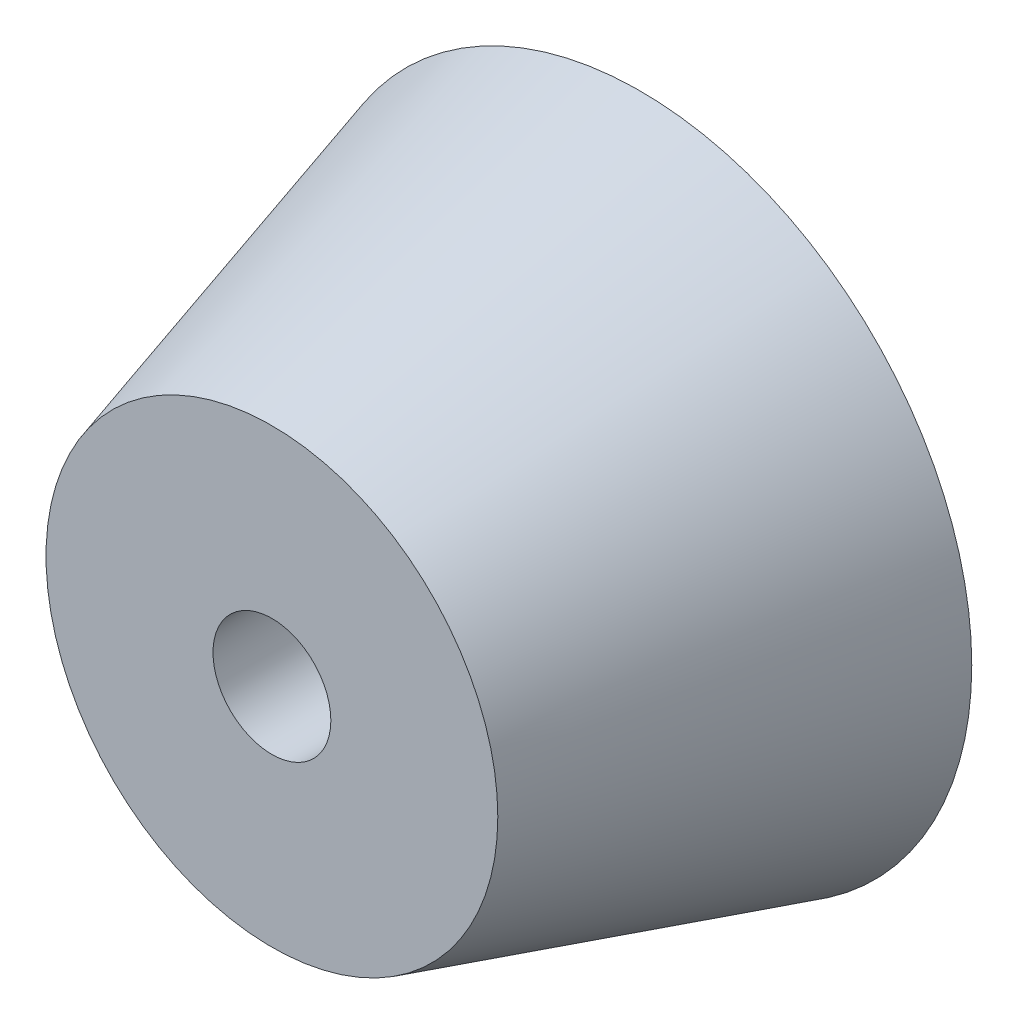
ISO-10303-21;
HEADER;
FILE_DESCRIPTION(('STEP AP214'),'2;1');
FILE_NAME('part.step','',(''),(''),'','','');
FILE_SCHEMA(('AUTOMOTIVE_DESIGN { 1 0 10303 214 1 1 1 1 }'));
ENDSEC;
DATA;
#1=APPLICATION_CONTEXT('core data for automotive mechanical design processes');
#2=APPLICATION_PROTOCOL_DEFINITION('international standard','automotive_design',2000,#1);
#3=PRODUCT_CONTEXT('',#1,'mechanical');
#4=PRODUCT('Part','Part','',(#3));
#5=PRODUCT_RELATED_PRODUCT_CATEGORY('part','',(#4));
#6=PRODUCT_DEFINITION_FORMATION('','',#4);
#7=PRODUCT_DEFINITION_CONTEXT('part definition',#1,'design');
#8=PRODUCT_DEFINITION('design','',#6,#7);
#9=PRODUCT_DEFINITION_SHAPE('','',#8);
#10=(LENGTH_UNIT() NAMED_UNIT(*) SI_UNIT(.MILLI.,.METRE.));
#11=(NAMED_UNIT(*) PLANE_ANGLE_UNIT() SI_UNIT($,.RADIAN.));
#12=(NAMED_UNIT(*) SI_UNIT($,.STERADIAN.) SOLID_ANGLE_UNIT());
#13=UNCERTAINTY_MEASURE_WITH_UNIT(LENGTH_MEASURE(1.E-05),#10,'distance_accuracy_value','');
#14=(GEOMETRIC_REPRESENTATION_CONTEXT(3) GLOBAL_UNCERTAINTY_ASSIGNED_CONTEXT((#13)) GLOBAL_UNIT_ASSIGNED_CONTEXT((#10,
#11,#12)) REPRESENTATION_CONTEXT('',''));
#15=CARTESIAN_POINT('',(0.,0.,0.));
#16=DIRECTION('',(0.,0.,1.));
#17=DIRECTION('',(1.,0.,0.));
#18=AXIS2_PLACEMENT_3D('',#15,#16,#17);
#19=CARTESIAN_POINT('',(-45.5703761802703,-345.935502046954,-36.1000000000002));
#20=DIRECTION('',(0.,0.,-1.));
#21=DIRECTION('',(1.,0.,0.));
#22=AXIS2_PLACEMENT_3D('',#19,#20,#21);
#23=CONICAL_SURFACE('',#22,9.00000000000001,0.279252680319093);
#24=CARTESIAN_POINT('',(-45.5703761802703,-345.935502046954,-26.1000000000002));
#25=DIRECTION('',(0.,0.,1.));
#26=DIRECTION('',(1.,0.,0.));
#27=AXIS2_PLACEMENT_3D('',#24,#25,#26);
#28=CIRCLE('',#27,6.13254614241193);
#29=CARTESIAN_POINT('',(-39.4378300378584,-345.935502046954,-26.1000000000002));
#30=VERTEX_POINT('',#29);
#31=EDGE_CURVE('E10',#30,#30,#28,.T.);
#32=ORIENTED_EDGE('',*,*,#31,.F.);
#33=EDGE_LOOP('',(#32));
#34=FACE_BOUND('',#33,.T.);
#35=CARTESIAN_POINT('',(-45.5703761802703,-345.935502046954,-36.1000000000002));
#36=DIRECTION('',(0.,0.,1.));
#37=DIRECTION('',(1.,0.,0.));
#38=AXIS2_PLACEMENT_3D('',#35,#36,#37);
#39=CIRCLE('',#38,9.00000000000001);
#40=CARTESIAN_POINT('',(-36.5703761802703,-345.935502046954,-36.1000000000002));
#41=VERTEX_POINT('',#40);
#42=EDGE_CURVE('E36',#41,#41,#39,.T.);
#43=ORIENTED_EDGE('',*,*,#42,.T.);
#44=EDGE_LOOP('',(#43));
#45=FACE_BOUND('',#44,.T.);
#46=ADVANCED_FACE('F30',(#34,#45),#23,.T.);
#47=CARTESIAN_POINT('',(-45.5703761802703,-345.935502046954,-26.1000000000002));
#48=DIRECTION('',(0.,0.,1.));
#49=DIRECTION('',(1.,0.,0.));
#50=AXIS2_PLACEMENT_3D('',#47,#48,#49);
#51=PLANE('',#50);
#52=CARTESIAN_POINT('',(-45.5703761802703,-345.935502046954,-26.1000000000002));
#53=DIRECTION('',(0.,0.,1.));
#54=DIRECTION('',(1.,0.,0.));
#55=AXIS2_PLACEMENT_3D('',#52,#53,#54);
#56=CIRCLE('',#55,1.6);
#57=CARTESIAN_POINT('',(-43.9703761802703,-345.935502046954,-26.1000000000002));
#58=VERTEX_POINT('',#57);
#59=EDGE_CURVE('E44',#58,#58,#56,.T.);
#60=ORIENTED_EDGE('',*,*,#59,.F.);
#61=EDGE_LOOP('',(#60));
#62=FACE_BOUND('',#61,.T.);
#63=ORIENTED_EDGE('',*,*,#31,.T.);
#64=EDGE_LOOP('',(#63));
#65=FACE_BOUND('',#64,.T.);
#66=ADVANCED_FACE('F52',(#62,#65),#51,.T.);
#67=CARTESIAN_POINT('',(-45.5703761802703,-345.935502046954,-36.1000000000002));
#68=DIRECTION('',(0.,0.,1.));
#69=DIRECTION('',(1.,0.,0.));
#70=AXIS2_PLACEMENT_3D('',#67,#68,#69);
#71=PLANE('',#70);
#72=CARTESIAN_POINT('',(-45.5703761802703,-345.935502046954,-36.1000000000002));
#73=DIRECTION('',(0.,0.,1.));
#74=DIRECTION('',(1.,0.,0.));
#75=AXIS2_PLACEMENT_3D('',#72,#73,#74);
#76=CIRCLE('',#75,1.6);
#77=CARTESIAN_POINT('',(-43.9703761802703,-345.935502046954,-36.1000000000002));
#78=VERTEX_POINT('',#77);
#79=EDGE_CURVE('E40',#78,#78,#76,.T.);
#80=ORIENTED_EDGE('',*,*,#79,.T.);
#81=EDGE_LOOP('',(#80));
#82=FACE_BOUND('',#81,.T.);
#83=ORIENTED_EDGE('',*,*,#42,.F.);
#84=EDGE_LOOP('',(#83));
#85=FACE_BOUND('',#84,.T.);
#86=ADVANCED_FACE('F54',(#82,#85),#71,.F.);
#87=CARTESIAN_POINT('',(-45.5703761802703,-345.935502046954,-26.1000000000002));
#88=DIRECTION('',(0.,0.,1.));
#89=DIRECTION('',(1.,0.,0.));
#90=AXIS2_PLACEMENT_3D('',#87,#88,#89);
#91=CYLINDRICAL_SURFACE('',#90,1.6);
#92=ORIENTED_EDGE('',*,*,#79,.F.);
#93=EDGE_LOOP('',(#92));
#94=FACE_BOUND('',#93,.T.);
#95=ORIENTED_EDGE('',*,*,#59,.T.);
#96=EDGE_LOOP('',(#95));
#97=FACE_BOUND('',#96,.T.);
#98=ADVANCED_FACE('F50',(#94,#97),#91,.F.);
#99=CLOSED_SHELL('',(#46,#66,#86,#98));
#100=MANIFOLD_SOLID_BREP('B2',#99);
#101=ADVANCED_BREP_SHAPE_REPRESENTATION('',(#18,#100),#14);
#102=SHAPE_DEFINITION_REPRESENTATION(#9,#101);
ENDSEC;
END-ISO-10303-21;
